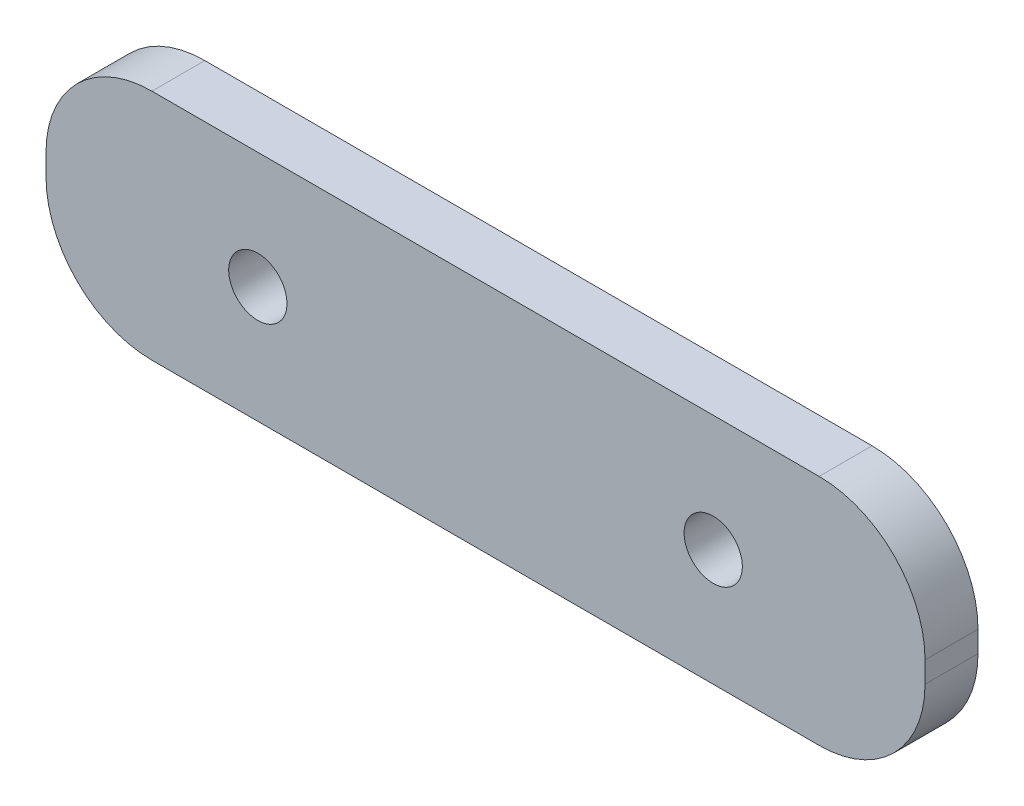
ISO-10303-21;
HEADER;
FILE_DESCRIPTION(('STEP AP214'),'2;1');
FILE_NAME('part.step','',(''),(''),'','','');
FILE_SCHEMA(('AUTOMOTIVE_DESIGN { 1 0 10303 214 1 1 1 1 }'));
ENDSEC;
DATA;
#1=APPLICATION_CONTEXT('core data for automotive mechanical design processes');
#2=APPLICATION_PROTOCOL_DEFINITION('international standard','automotive_design',2000,#1);
#3=PRODUCT_CONTEXT('',#1,'mechanical');
#4=PRODUCT('Part','Part','',(#3));
#5=PRODUCT_RELATED_PRODUCT_CATEGORY('part','',(#4));
#6=PRODUCT_DEFINITION_FORMATION('','',#4);
#7=PRODUCT_DEFINITION_CONTEXT('part definition',#1,'design');
#8=PRODUCT_DEFINITION('design','',#6,#7);
#9=PRODUCT_DEFINITION_SHAPE('','',#8);
#10=(LENGTH_UNIT() NAMED_UNIT(*) SI_UNIT(.MILLI.,.METRE.));
#11=(NAMED_UNIT(*) PLANE_ANGLE_UNIT() SI_UNIT($,.RADIAN.));
#12=(NAMED_UNIT(*) SI_UNIT($,.STERADIAN.) SOLID_ANGLE_UNIT());
#13=UNCERTAINTY_MEASURE_WITH_UNIT(LENGTH_MEASURE(1.E-05),#10,'distance_accuracy_value','');
#14=(GEOMETRIC_REPRESENTATION_CONTEXT(3) GLOBAL_UNCERTAINTY_ASSIGNED_CONTEXT((#13)) GLOBAL_UNIT_ASSIGNED_CONTEXT((#10,
#11,#12)) REPRESENTATION_CONTEXT('',''));
#15=CARTESIAN_POINT('',(0.,0.,0.));
#16=DIRECTION('',(0.,0.,1.));
#17=DIRECTION('',(1.,0.,0.));
#18=AXIS2_PLACEMENT_3D('',#15,#16,#17);
#19=CARTESIAN_POINT('',(41.5,-33.5,5.));
#20=DIRECTION('',(-1.,0.,0.));
#21=DIRECTION('',(0.,0.,1.));
#22=AXIS2_PLACEMENT_3D('',#19,#20,#21);
#23=PLANE('',#22);
#24=DIRECTION('',(0.,1.,0.));
#25=VECTOR('',#24,1.);
#26=CARTESIAN_POINT('',(41.5,-33.5,0.));
#27=LINE('',#26,#25);
#28=CARTESIAN_POINT('',(41.5,-23.5,0.));
#29=VERTEX_POINT('',#28);
#30=CARTESIAN_POINT('',(41.5,-21.5,0.));
#31=VERTEX_POINT('',#30);
#32=EDGE_CURVE('E125',#29,#31,#27,.T.);
#33=ORIENTED_EDGE('',*,*,#32,.T.);
#34=DIRECTION('',(0.,0.,1.));
#35=VECTOR('',#34,1.);
#36=CARTESIAN_POINT('',(41.5,-21.5,5.));
#37=LINE('',#36,#35);
#38=CARTESIAN_POINT('',(41.5,-21.5,5.));
#39=VERTEX_POINT('',#38);
#40=EDGE_CURVE('E158',#31,#39,#37,.T.);
#41=ORIENTED_EDGE('',*,*,#40,.T.);
#42=DIRECTION('',(0.,1.,0.));
#43=VECTOR('',#42,1.);
#44=CARTESIAN_POINT('',(41.5,-33.5,5.));
#45=LINE('',#44,#43);
#46=CARTESIAN_POINT('',(41.5,-23.5,5.));
#47=VERTEX_POINT('',#46);
#48=EDGE_CURVE('E128',#47,#39,#45,.T.);
#49=ORIENTED_EDGE('',*,*,#48,.F.);
#50=DIRECTION('',(0.,0.,-1.));
#51=VECTOR('',#50,1.);
#52=CARTESIAN_POINT('',(41.5,-23.5,5.));
#53=LINE('',#52,#51);
#54=EDGE_CURVE('E112',#47,#29,#53,.T.);
#55=ORIENTED_EDGE('',*,*,#54,.T.);
#56=EDGE_LOOP('',(#33,#41,#49,#55));
#57=FACE_BOUND('',#56,.T.);
#58=ADVANCED_FACE('F41',(#57),#23,.F.);
#59=CARTESIAN_POINT('',(-41.5,-33.5,5.));
#60=DIRECTION('',(1.,0.,0.));
#61=DIRECTION('',(0.,0.,-1.));
#62=AXIS2_PLACEMENT_3D('',#59,#60,#61);
#63=PLANE('',#62);
#64=DIRECTION('',(0.,-1.,0.));
#65=VECTOR('',#64,1.);
#66=CARTESIAN_POINT('',(-41.5,-33.5,5.));
#67=LINE('',#66,#65);
#68=CARTESIAN_POINT('',(-41.5,-21.5,5.));
#69=VERTEX_POINT('',#68);
#70=CARTESIAN_POINT('',(-41.5,-23.5,5.));
#71=VERTEX_POINT('',#70);
#72=EDGE_CURVE('E178',#69,#71,#67,.T.);
#73=ORIENTED_EDGE('',*,*,#72,.F.);
#74=DIRECTION('',(0.,0.,-1.));
#75=VECTOR('',#74,1.);
#76=CARTESIAN_POINT('',(-41.5,-21.5,5.));
#77=LINE('',#76,#75);
#78=CARTESIAN_POINT('',(-41.5,-21.5,0.));
#79=VERTEX_POINT('',#78);
#80=EDGE_CURVE('E11',#69,#79,#77,.T.);
#81=ORIENTED_EDGE('',*,*,#80,.T.);
#82=DIRECTION('',(0.,-1.,0.));
#83=VECTOR('',#82,1.);
#84=CARTESIAN_POINT('',(-41.5,-33.5,0.));
#85=LINE('',#84,#83);
#86=CARTESIAN_POINT('',(-41.5,-23.5,0.));
#87=VERTEX_POINT('',#86);
#88=EDGE_CURVE('E134',#79,#87,#85,.T.);
#89=ORIENTED_EDGE('',*,*,#88,.T.);
#90=DIRECTION('',(0.,0.,-1.));
#91=VECTOR('',#90,1.);
#92=CARTESIAN_POINT('',(-41.5,-23.5,5.));
#93=LINE('',#92,#91);
#94=EDGE_CURVE('E155',#87,#71,#93,.F.);
#95=ORIENTED_EDGE('',*,*,#94,.T.);
#96=EDGE_LOOP('',(#73,#81,#89,#95));
#97=FACE_BOUND('',#96,.T.);
#98=ADVANCED_FACE('F180',(#97),#63,.F.);
#99=CARTESIAN_POINT('',(-41.5,-33.5,5.));
#100=DIRECTION('',(0.,1.,0.));
#101=DIRECTION('',(0.,0.,1.));
#102=AXIS2_PLACEMENT_3D('',#99,#100,#101);
#103=PLANE('',#102);
#104=DIRECTION('',(1.,0.,0.));
#105=VECTOR('',#104,1.);
#106=CARTESIAN_POINT('',(-41.5,-33.5,0.));
#107=LINE('',#106,#105);
#108=CARTESIAN_POINT('',(-31.5,-33.5,0.));
#109=VERTEX_POINT('',#108);
#110=CARTESIAN_POINT('',(31.5,-33.5,0.));
#111=VERTEX_POINT('',#110);
#112=EDGE_CURVE('E137',#109,#111,#107,.T.);
#113=ORIENTED_EDGE('',*,*,#112,.T.);
#114=DIRECTION('',(0.,0.,-1.));
#115=VECTOR('',#114,1.);
#116=CARTESIAN_POINT('',(31.5,-33.5,5.));
#117=LINE('',#116,#115);
#118=CARTESIAN_POINT('',(31.5,-33.5,5.));
#119=VERTEX_POINT('',#118);
#120=EDGE_CURVE('E113',#111,#119,#117,.F.);
#121=ORIENTED_EDGE('',*,*,#120,.T.);
#122=DIRECTION('',(1.,0.,0.));
#123=VECTOR('',#122,1.);
#124=CARTESIAN_POINT('',(-41.5,-33.5,5.));
#125=LINE('',#124,#123);
#126=CARTESIAN_POINT('',(-31.5,-33.5,5.));
#127=VERTEX_POINT('',#126);
#128=EDGE_CURVE('E129',#127,#119,#125,.T.);
#129=ORIENTED_EDGE('',*,*,#128,.F.);
#130=DIRECTION('',(0.,0.,-1.));
#131=VECTOR('',#130,1.);
#132=CARTESIAN_POINT('',(-31.5,-33.5,5.));
#133=LINE('',#132,#131);
#134=EDGE_CURVE('E118',#127,#109,#133,.T.);
#135=ORIENTED_EDGE('',*,*,#134,.T.);
#136=EDGE_LOOP('',(#113,#121,#129,#135));
#137=FACE_BOUND('',#136,.T.);
#138=ADVANCED_FACE('F198',(#137),#103,.F.);
#139=CARTESIAN_POINT('',(0.,0.,5.));
#140=DIRECTION('',(0.,0.,-1.));
#141=DIRECTION('',(-1.,0.,0.));
#142=AXIS2_PLACEMENT_3D('',#139,#140,#141);
#143=PLANE('',#142);
#144=CARTESIAN_POINT('',(21.5,-22.5,5.));
#145=DIRECTION('',(0.,0.,1.));
#146=DIRECTION('',(1.,0.,0.));
#147=AXIS2_PLACEMENT_3D('',#144,#145,#146);
#148=CIRCLE('',#147,2.75);
#149=CARTESIAN_POINT('',(24.25,-22.5,5.));
#150=VERTEX_POINT('',#149);
#151=EDGE_CURVE('E171',#150,#150,#148,.T.);
#152=ORIENTED_EDGE('',*,*,#151,.F.);
#153=EDGE_LOOP('',(#152));
#154=FACE_BOUND('',#153,.T.);
#155=CARTESIAN_POINT('',(-21.5,-22.5,5.));
#156=DIRECTION('',(0.,0.,1.));
#157=DIRECTION('',(1.,0.,0.));
#158=AXIS2_PLACEMENT_3D('',#155,#156,#157);
#159=CIRCLE('',#158,2.75);
#160=CARTESIAN_POINT('',(-18.75,-22.5,5.));
#161=VERTEX_POINT('',#160);
#162=EDGE_CURVE('E140',#161,#161,#159,.T.);
#163=ORIENTED_EDGE('',*,*,#162,.F.);
#164=EDGE_LOOP('',(#163));
#165=FACE_BOUND('',#164,.T.);
#166=ORIENTED_EDGE('',*,*,#48,.T.);
#167=CARTESIAN_POINT('',(31.5,-21.5,5.));
#168=DIRECTION('',(0.,0.,-1.));
#169=DIRECTION('',(-1.,0.,0.));
#170=AXIS2_PLACEMENT_3D('',#167,#168,#169);
#171=CIRCLE('',#170,10.);
#172=CARTESIAN_POINT('',(31.5,-11.5,5.));
#173=VERTEX_POINT('',#172);
#174=EDGE_CURVE('E162',#39,#173,#171,.F.);
#175=ORIENTED_EDGE('',*,*,#174,.T.);
#176=DIRECTION('',(1.,0.,0.));
#177=VECTOR('',#176,1.);
#178=CARTESIAN_POINT('',(-45.5745294773777,-11.5,5.));
#179=LINE('',#178,#177);
#180=CARTESIAN_POINT('',(-31.5,-11.5,5.));
#181=VERTEX_POINT('',#180);
#182=EDGE_CURVE('E172',#181,#173,#179,.T.);
#183=ORIENTED_EDGE('',*,*,#182,.F.);
#184=CARTESIAN_POINT('',(-31.5,-21.5,5.));
#185=DIRECTION('',(0.,0.,-1.));
#186=DIRECTION('',(-1.,0.,0.));
#187=AXIS2_PLACEMENT_3D('',#184,#185,#186);
#188=CIRCLE('',#187,10.);
#189=EDGE_CURVE('E160',#181,#69,#188,.F.);
#190=ORIENTED_EDGE('',*,*,#189,.T.);
#191=ORIENTED_EDGE('',*,*,#72,.T.);
#192=CARTESIAN_POINT('',(-31.5,-23.5,5.));
#193=DIRECTION('',(0.,0.,-1.));
#194=DIRECTION('',(-1.,0.,0.));
#195=AXIS2_PLACEMENT_3D('',#192,#193,#194);
#196=CIRCLE('',#195,10.);
#197=EDGE_CURVE('E151',#71,#127,#196,.F.);
#198=ORIENTED_EDGE('',*,*,#197,.T.);
#199=ORIENTED_EDGE('',*,*,#128,.T.);
#200=CARTESIAN_POINT('',(31.5,-23.5,5.));
#201=DIRECTION('',(0.,0.,-1.));
#202=DIRECTION('',(-1.,0.,0.));
#203=AXIS2_PLACEMENT_3D('',#200,#201,#202);
#204=CIRCLE('',#203,10.);
#205=EDGE_CURVE('E153',#119,#47,#204,.F.);
#206=ORIENTED_EDGE('',*,*,#205,.T.);
#207=EDGE_LOOP('',(#166,#175,#183,#190,#191,#198,#199,#206));
#208=FACE_BOUND('',#207,.T.);
#209=ADVANCED_FACE('F177',(#154,#165,#208),#143,.F.);
#210=CARTESIAN_POINT('',(0.,0.,0.));
#211=DIRECTION('',(0.,0.,-1.));
#212=DIRECTION('',(-1.,0.,0.));
#213=AXIS2_PLACEMENT_3D('',#210,#211,#212);
#214=PLANE('',#213);
#215=DIRECTION('',(1.,0.,0.));
#216=VECTOR('',#215,1.);
#217=CARTESIAN_POINT('',(-45.5745294773777,-11.5,0.));
#218=LINE('',#217,#216);
#219=CARTESIAN_POINT('',(-31.5,-11.5,0.));
#220=VERTEX_POINT('',#219);
#221=CARTESIAN_POINT('',(31.5,-11.5,0.));
#222=VERTEX_POINT('',#221);
#223=EDGE_CURVE('E168',#220,#222,#218,.T.);
#224=ORIENTED_EDGE('',*,*,#223,.T.);
#225=CARTESIAN_POINT('',(31.5,-21.5,0.));
#226=DIRECTION('',(0.,0.,-1.));
#227=DIRECTION('',(-1.,0.,0.));
#228=AXIS2_PLACEMENT_3D('',#225,#226,#227);
#229=CIRCLE('',#228,10.);
#230=EDGE_CURVE('E49',#222,#31,#229,.T.);
#231=ORIENTED_EDGE('',*,*,#230,.T.);
#232=ORIENTED_EDGE('',*,*,#32,.F.);
#233=CARTESIAN_POINT('',(31.5,-23.5,0.));
#234=DIRECTION('',(0.,0.,-1.));
#235=DIRECTION('',(-1.,0.,0.));
#236=AXIS2_PLACEMENT_3D('',#233,#234,#235);
#237=CIRCLE('',#236,10.);
#238=EDGE_CURVE('E108',#29,#111,#237,.T.);
#239=ORIENTED_EDGE('',*,*,#238,.T.);
#240=ORIENTED_EDGE('',*,*,#112,.F.);
#241=CARTESIAN_POINT('',(-31.5,-23.5,0.));
#242=DIRECTION('',(0.,0.,-1.));
#243=DIRECTION('',(-1.,0.,0.));
#244=AXIS2_PLACEMENT_3D('',#241,#242,#243);
#245=CIRCLE('',#244,10.);
#246=EDGE_CURVE('E119',#109,#87,#245,.T.);
#247=ORIENTED_EDGE('',*,*,#246,.T.);
#248=ORIENTED_EDGE('',*,*,#88,.F.);
#249=CARTESIAN_POINT('',(-31.5,-21.5,0.));
#250=DIRECTION('',(0.,0.,-1.));
#251=DIRECTION('',(-1.,0.,0.));
#252=AXIS2_PLACEMENT_3D('',#249,#250,#251);
#253=CIRCLE('',#252,10.);
#254=EDGE_CURVE('E56',#79,#220,#253,.T.);
#255=ORIENTED_EDGE('',*,*,#254,.T.);
#256=EDGE_LOOP('',(#224,#231,#232,#239,#240,#247,#248,#255));
#257=FACE_BOUND('',#256,.T.);
#258=CARTESIAN_POINT('',(21.5,-22.5,0.));
#259=DIRECTION('',(0.,0.,1.));
#260=DIRECTION('',(1.,0.,0.));
#261=AXIS2_PLACEMENT_3D('',#258,#259,#260);
#262=CIRCLE('',#261,2.75);
#263=CARTESIAN_POINT('',(24.25,-22.5,0.));
#264=VERTEX_POINT('',#263);
#265=EDGE_CURVE('E188',#264,#264,#262,.T.);
#266=ORIENTED_EDGE('',*,*,#265,.T.);
#267=EDGE_LOOP('',(#266));
#268=FACE_BOUND('',#267,.T.);
#269=CARTESIAN_POINT('',(-21.5,-22.5,0.));
#270=DIRECTION('',(0.,0.,1.));
#271=DIRECTION('',(1.,0.,0.));
#272=AXIS2_PLACEMENT_3D('',#269,#270,#271);
#273=CIRCLE('',#272,2.75);
#274=CARTESIAN_POINT('',(-18.75,-22.5,0.));
#275=VERTEX_POINT('',#274);
#276=EDGE_CURVE('E135',#275,#275,#273,.T.);
#277=ORIENTED_EDGE('',*,*,#276,.T.);
#278=EDGE_LOOP('',(#277));
#279=FACE_BOUND('',#278,.T.);
#280=ADVANCED_FACE('F131',(#257,#268,#279),#214,.T.);
#281=CARTESIAN_POINT('',(-21.5,-22.5,5.));
#282=DIRECTION('',(0.,0.,1.));
#283=DIRECTION('',(1.,0.,0.));
#284=AXIS2_PLACEMENT_3D('',#281,#282,#283);
#285=CYLINDRICAL_SURFACE('',#284,2.75);
#286=ORIENTED_EDGE('',*,*,#276,.F.);
#287=EDGE_LOOP('',(#286));
#288=FACE_BOUND('',#287,.T.);
#289=ORIENTED_EDGE('',*,*,#162,.T.);
#290=EDGE_LOOP('',(#289));
#291=FACE_BOUND('',#290,.T.);
#292=ADVANCED_FACE('F221',(#288,#291),#285,.F.);
#293=CARTESIAN_POINT('',(21.5,-22.5,5.));
#294=DIRECTION('',(0.,0.,1.));
#295=DIRECTION('',(1.,0.,0.));
#296=AXIS2_PLACEMENT_3D('',#293,#294,#295);
#297=CYLINDRICAL_SURFACE('',#296,2.75);
#298=ORIENTED_EDGE('',*,*,#265,.F.);
#299=EDGE_LOOP('',(#298));
#300=FACE_BOUND('',#299,.T.);
#301=ORIENTED_EDGE('',*,*,#151,.T.);
#302=EDGE_LOOP('',(#301));
#303=FACE_BOUND('',#302,.T.);
#304=ADVANCED_FACE('F208',(#300,#303),#297,.F.);
#305=CARTESIAN_POINT('',(31.5,-23.5,5.));
#306=DIRECTION('',(0.,0.,-1.));
#307=DIRECTION('',(-1.,0.,0.));
#308=AXIS2_PLACEMENT_3D('',#305,#306,#307);
#309=CYLINDRICAL_SURFACE('',#308,10.);
#310=ORIENTED_EDGE('',*,*,#205,.F.);
#311=ORIENTED_EDGE('',*,*,#120,.F.);
#312=ORIENTED_EDGE('',*,*,#238,.F.);
#313=ORIENTED_EDGE('',*,*,#54,.F.);
#314=EDGE_LOOP('',(#310,#311,#312,#313));
#315=FACE_BOUND('',#314,.T.);
#316=ADVANCED_FACE('F111',(#315),#309,.T.);
#317=CARTESIAN_POINT('',(-31.5,-23.5,5.));
#318=DIRECTION('',(0.,0.,-1.));
#319=DIRECTION('',(-1.,0.,0.));
#320=AXIS2_PLACEMENT_3D('',#317,#318,#319);
#321=CYLINDRICAL_SURFACE('',#320,10.);
#322=ORIENTED_EDGE('',*,*,#197,.F.);
#323=ORIENTED_EDGE('',*,*,#94,.F.);
#324=ORIENTED_EDGE('',*,*,#246,.F.);
#325=ORIENTED_EDGE('',*,*,#134,.F.);
#326=EDGE_LOOP('',(#322,#323,#324,#325));
#327=FACE_BOUND('',#326,.T.);
#328=ADVANCED_FACE('F200',(#327),#321,.T.);
#329=CARTESIAN_POINT('',(-45.5745294773777,-11.5,0.));
#330=DIRECTION('',(0.,-1.,0.));
#331=DIRECTION('',(0.,0.,-1.));
#332=AXIS2_PLACEMENT_3D('',#329,#330,#331);
#333=PLANE('',#332);
#334=ORIENTED_EDGE('',*,*,#182,.T.);
#335=DIRECTION('',(0.,0.,1.));
#336=VECTOR('',#335,1.);
#337=CARTESIAN_POINT('',(31.5,-11.5,0.));
#338=LINE('',#337,#336);
#339=EDGE_CURVE('E63',#173,#222,#338,.F.);
#340=ORIENTED_EDGE('',*,*,#339,.T.);
#341=ORIENTED_EDGE('',*,*,#223,.F.);
#342=DIRECTION('',(0.,0.,-1.));
#343=VECTOR('',#342,1.);
#344=CARTESIAN_POINT('',(-31.5,-11.5,0.));
#345=LINE('',#344,#343);
#346=EDGE_CURVE('E164',#220,#181,#345,.F.);
#347=ORIENTED_EDGE('',*,*,#346,.T.);
#348=EDGE_LOOP('',(#334,#340,#341,#347));
#349=FACE_BOUND('',#348,.T.);
#350=ADVANCED_FACE('F169',(#349),#333,.F.);
#351=CARTESIAN_POINT('',(31.5,-21.5,5.));
#352=DIRECTION('',(0.,0.,1.));
#353=DIRECTION('',(1.,0.,0.));
#354=AXIS2_PLACEMENT_3D('',#351,#352,#353);
#355=CYLINDRICAL_SURFACE('',#354,10.);
#356=ORIENTED_EDGE('',*,*,#230,.F.);
#357=ORIENTED_EDGE('',*,*,#339,.F.);
#358=ORIENTED_EDGE('',*,*,#174,.F.);
#359=ORIENTED_EDGE('',*,*,#40,.F.);
#360=EDGE_LOOP('',(#356,#357,#358,#359));
#361=FACE_BOUND('',#360,.T.);
#362=ADVANCED_FACE('F194',(#361),#355,.T.);
#363=CARTESIAN_POINT('',(-31.5,-21.5,5.));
#364=DIRECTION('',(0.,0.,-1.));
#365=DIRECTION('',(-1.,0.,0.));
#366=AXIS2_PLACEMENT_3D('',#363,#364,#365);
#367=CYLINDRICAL_SURFACE('',#366,10.);
#368=ORIENTED_EDGE('',*,*,#189,.F.);
#369=ORIENTED_EDGE('',*,*,#346,.F.);
#370=ORIENTED_EDGE('',*,*,#254,.F.);
#371=ORIENTED_EDGE('',*,*,#80,.F.);
#372=EDGE_LOOP('',(#368,#369,#370,#371));
#373=FACE_BOUND('',#372,.T.);
#374=ADVANCED_FACE('F43',(#373),#367,.T.);
#375=CLOSED_SHELL('',(#58,#98,#138,#209,#280,#292,#304,#316,#328,#350,#362,#374));
#376=MANIFOLD_SOLID_BREP('B2',#375);
#377=ADVANCED_BREP_SHAPE_REPRESENTATION('',(#18,#376),#14);
#378=SHAPE_DEFINITION_REPRESENTATION(#9,#377);
ENDSEC;
END-ISO-10303-21;
